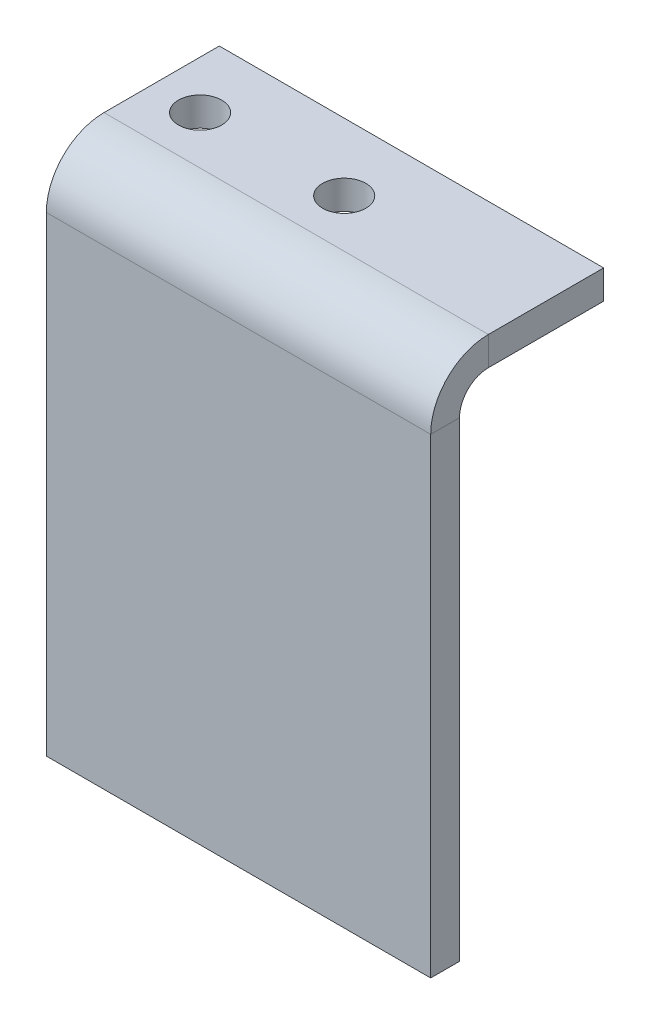
ISO-10303-21;
HEADER;
FILE_DESCRIPTION(('STEP AP214'),'2;1');
FILE_NAME('part.step','',(''),(''),'','','');
FILE_SCHEMA(('AUTOMOTIVE_DESIGN { 1 0 10303 214 1 1 1 1 }'));
ENDSEC;
DATA;
#1=APPLICATION_CONTEXT('core data for automotive mechanical design processes');
#2=APPLICATION_PROTOCOL_DEFINITION('international standard','automotive_design',2000,#1);
#3=PRODUCT_CONTEXT('',#1,'mechanical');
#4=PRODUCT('Part','Part','',(#3));
#5=PRODUCT_RELATED_PRODUCT_CATEGORY('part','',(#4));
#6=PRODUCT_DEFINITION_FORMATION('','',#4);
#7=PRODUCT_DEFINITION_CONTEXT('part definition',#1,'design');
#8=PRODUCT_DEFINITION('design','',#6,#7);
#9=PRODUCT_DEFINITION_SHAPE('','',#8);
#10=(LENGTH_UNIT() NAMED_UNIT(*) SI_UNIT(.MILLI.,.METRE.));
#11=(NAMED_UNIT(*) PLANE_ANGLE_UNIT() SI_UNIT($,.RADIAN.));
#12=(NAMED_UNIT(*) SI_UNIT($,.STERADIAN.) SOLID_ANGLE_UNIT());
#13=UNCERTAINTY_MEASURE_WITH_UNIT(LENGTH_MEASURE(1.E-05),#10,'distance_accuracy_value','');
#14=(GEOMETRIC_REPRESENTATION_CONTEXT(3) GLOBAL_UNCERTAINTY_ASSIGNED_CONTEXT((#13)) GLOBAL_UNIT_ASSIGNED_CONTEXT((#10,
#11,#12)) REPRESENTATION_CONTEXT('',''));
#15=CARTESIAN_POINT('',(0.,0.,0.));
#16=DIRECTION('',(0.,0.,1.));
#17=DIRECTION('',(1.,0.,0.));
#18=AXIS2_PLACEMENT_3D('',#15,#16,#17);
#19=CARTESIAN_POINT('',(20.,-27.5,2.));
#20=DIRECTION('',(-1.,0.,0.));
#21=DIRECTION('',(0.,1.,0.));
#22=AXIS2_PLACEMENT_3D('',#19,#20,#21);
#23=PLANE('',#22);
#24=DIRECTION('',(0.,1.,0.));
#25=VECTOR('',#24,1.);
#26=CARTESIAN_POINT('',(20.,0.,-1.));
#27=LINE('',#26,#25);
#28=CARTESIAN_POINT('',(20.,-27.5,-1.));
#29=VERTEX_POINT('',#28);
#30=CARTESIAN_POINT('',(20.,21.5,-1.));
#31=VERTEX_POINT('',#30);
#32=EDGE_CURVE('E194',#29,#31,#27,.T.);
#33=ORIENTED_EDGE('',*,*,#32,.T.);
#34=DIRECTION('',(0.,0.,1.));
#35=VECTOR('',#34,1.);
#36=CARTESIAN_POINT('',(20.,21.5,-1.));
#37=LINE('',#36,#35);
#38=CARTESIAN_POINT('',(20.,21.5,2.));
#39=VERTEX_POINT('',#38);
#40=EDGE_CURVE('E181',#31,#39,#37,.T.);
#41=ORIENTED_EDGE('',*,*,#40,.T.);
#42=DIRECTION('',(0.,1.,0.));
#43=VECTOR('',#42,1.);
#44=CARTESIAN_POINT('',(20.,-27.5,2.));
#45=LINE('',#44,#43);
#46=CARTESIAN_POINT('',(20.,-27.5,2.));
#47=VERTEX_POINT('',#46);
#48=EDGE_CURVE('E197',#47,#39,#45,.T.);
#49=ORIENTED_EDGE('',*,*,#48,.F.);
#50=DIRECTION('',(0.,0.,1.));
#51=VECTOR('',#50,1.);
#52=CARTESIAN_POINT('',(20.,-27.5,2.));
#53=LINE('',#52,#51);
#54=EDGE_CURVE('E67',#29,#47,#53,.T.);
#55=ORIENTED_EDGE('',*,*,#54,.F.);
#56=EDGE_LOOP('',(#33,#41,#49,#55));
#57=FACE_BOUND('',#56,.T.);
#58=ADVANCED_FACE('F59',(#57),#23,.F.);
#59=CARTESIAN_POINT('',(0.,0.,2.));
#60=DIRECTION('',(0.,0.,-1.));
#61=DIRECTION('',(-1.,0.,0.));
#62=AXIS2_PLACEMENT_3D('',#59,#60,#61);
#63=PLANE('',#62);
#64=DIRECTION('',(1.,0.,0.));
#65=VECTOR('',#64,1.);
#66=CARTESIAN_POINT('',(20.,21.5,2.));
#67=LINE('',#66,#65);
#68=CARTESIAN_POINT('',(-20.,21.5,2.));
#69=VERTEX_POINT('',#68);
#70=EDGE_CURVE('E101',#39,#69,#67,.F.);
#71=ORIENTED_EDGE('',*,*,#70,.T.);
#72=DIRECTION('',(0.,-1.,0.));
#73=VECTOR('',#72,1.);
#74=CARTESIAN_POINT('',(-20.,-27.5,2.));
#75=LINE('',#74,#73);
#76=CARTESIAN_POINT('',(-20.,-27.5,2.));
#77=VERTEX_POINT('',#76);
#78=EDGE_CURVE('E199',#69,#77,#75,.T.);
#79=ORIENTED_EDGE('',*,*,#78,.T.);
#80=DIRECTION('',(1.,0.,0.));
#81=VECTOR('',#80,1.);
#82=CARTESIAN_POINT('',(-20.,-27.5,2.));
#83=LINE('',#82,#81);
#84=EDGE_CURVE('E202',#77,#47,#83,.T.);
#85=ORIENTED_EDGE('',*,*,#84,.T.);
#86=ORIENTED_EDGE('',*,*,#48,.T.);
#87=EDGE_LOOP('',(#71,#79,#85,#86));
#88=FACE_BOUND('',#87,.T.);
#89=ADVANCED_FACE('F262',(#88),#63,.F.);
#90=CARTESIAN_POINT('',(0.,0.,-1.));
#91=DIRECTION('',(0.,0.,-1.));
#92=DIRECTION('',(-1.,0.,0.));
#93=AXIS2_PLACEMENT_3D('',#90,#91,#92);
#94=PLANE('',#93);
#95=DIRECTION('',(0.,1.,0.));
#96=VECTOR('',#95,1.);
#97=CARTESIAN_POINT('',(-20.,0.,-1.));
#98=LINE('',#97,#96);
#99=CARTESIAN_POINT('',(-20.,21.5,-1.));
#100=VERTEX_POINT('',#99);
#101=CARTESIAN_POINT('',(-20.,-27.5,-1.));
#102=VERTEX_POINT('',#101);
#103=EDGE_CURVE('E94',#100,#102,#98,.F.);
#104=ORIENTED_EDGE('',*,*,#103,.F.);
#105=DIRECTION('',(1.,0.,0.));
#106=VECTOR('',#105,1.);
#107=CARTESIAN_POINT('',(20.,21.5,-1.));
#108=LINE('',#107,#106);
#109=EDGE_CURVE('E74',#31,#100,#108,.F.);
#110=ORIENTED_EDGE('',*,*,#109,.F.);
#111=ORIENTED_EDGE('',*,*,#32,.F.);
#112=DIRECTION('',(-1.,0.,0.));
#113=VECTOR('',#112,1.);
#114=CARTESIAN_POINT('',(0.,-27.5,-1.));
#115=LINE('',#114,#113);
#116=EDGE_CURVE('E200',#102,#29,#115,.F.);
#117=ORIENTED_EDGE('',*,*,#116,.F.);
#118=EDGE_LOOP('',(#104,#110,#111,#117));
#119=FACE_BOUND('',#118,.T.);
#120=ADVANCED_FACE('F209',(#119),#94,.T.);
#121=CARTESIAN_POINT('',(-20.,-27.5,2.));
#122=DIRECTION('',(1.,0.,0.));
#123=DIRECTION('',(0.,-1.,0.));
#124=AXIS2_PLACEMENT_3D('',#121,#122,#123);
#125=PLANE('',#124);
#126=DIRECTION('',(0.,0.,1.));
#127=VECTOR('',#126,1.);
#128=CARTESIAN_POINT('',(-20.,21.5,-1.));
#129=LINE('',#128,#127);
#130=EDGE_CURVE('E191',#100,#69,#129,.T.);
#131=ORIENTED_EDGE('',*,*,#130,.F.);
#132=ORIENTED_EDGE('',*,*,#103,.T.);
#133=DIRECTION('',(0.,0.,1.));
#134=VECTOR('',#133,1.);
#135=CARTESIAN_POINT('',(-20.,-27.5,2.));
#136=LINE('',#135,#134);
#137=EDGE_CURVE('E13',#102,#77,#136,.T.);
#138=ORIENTED_EDGE('',*,*,#137,.T.);
#139=ORIENTED_EDGE('',*,*,#78,.F.);
#140=EDGE_LOOP('',(#131,#132,#138,#139));
#141=FACE_BOUND('',#140,.T.);
#142=ADVANCED_FACE('F61',(#141),#125,.F.);
#143=CARTESIAN_POINT('',(-20.,-27.5,2.));
#144=DIRECTION('',(0.,1.,0.));
#145=DIRECTION('',(1.,0.,0.));
#146=AXIS2_PLACEMENT_3D('',#143,#144,#145);
#147=PLANE('',#146);
#148=ORIENTED_EDGE('',*,*,#137,.F.);
#149=ORIENTED_EDGE('',*,*,#116,.T.);
#150=ORIENTED_EDGE('',*,*,#54,.T.);
#151=ORIENTED_EDGE('',*,*,#84,.F.);
#152=EDGE_LOOP('',(#148,#149,#150,#151));
#153=FACE_BOUND('',#152,.T.);
#154=ADVANCED_FACE('F208',(#153),#147,.F.);
#155=CARTESIAN_POINT('',(-20.,21.5,-4.));
#156=DIRECTION('',(-1.,0.,0.));
#157=DIRECTION('',(0.,0.,1.));
#158=AXIS2_PLACEMENT_3D('',#155,#156,#157);
#159=PLANE('',#158);
#160=DIRECTION('',(0.,-1.,0.));
#161=VECTOR('',#160,1.);
#162=CARTESIAN_POINT('',(-20.,27.5,-3.99999999999998));
#163=LINE('',#162,#161);
#164=CARTESIAN_POINT('',(-20.,24.5,-3.99999999999999));
#165=VERTEX_POINT('',#164);
#166=CARTESIAN_POINT('',(-20.,27.5,-3.99999999999998));
#167=VERTEX_POINT('',#166);
#168=EDGE_CURVE('E157',#165,#167,#163,.F.);
#169=ORIENTED_EDGE('',*,*,#168,.F.);
#170=CARTESIAN_POINT('',(-20.,21.5,-4.));
#171=DIRECTION('',(1.,0.,0.));
#172=DIRECTION('',(0.,0.,-1.));
#173=AXIS2_PLACEMENT_3D('',#170,#171,#172);
#174=CIRCLE('',#173,3.);
#175=EDGE_CURVE('E184',#100,#165,#174,.F.);
#176=ORIENTED_EDGE('',*,*,#175,.F.);
#177=ORIENTED_EDGE('',*,*,#130,.T.);
#178=CARTESIAN_POINT('',(-20.,21.5,-4.));
#179=DIRECTION('',(1.,0.,0.));
#180=DIRECTION('',(0.,0.,-1.));
#181=AXIS2_PLACEMENT_3D('',#178,#179,#180);
#182=CIRCLE('',#181,6.);
#183=EDGE_CURVE('E177',#69,#167,#182,.F.);
#184=ORIENTED_EDGE('',*,*,#183,.T.);
#185=EDGE_LOOP('',(#169,#176,#177,#184));
#186=FACE_BOUND('',#185,.T.);
#187=ADVANCED_FACE('F270',(#186),#159,.T.);
#188=CARTESIAN_POINT('',(20.,21.5,-4.));
#189=DIRECTION('',(-1.,0.,0.));
#190=DIRECTION('',(0.,0.,1.));
#191=AXIS2_PLACEMENT_3D('',#188,#189,#190);
#192=PLANE('',#191);
#193=CARTESIAN_POINT('',(20.,21.5,-4.));
#194=DIRECTION('',(1.,0.,0.));
#195=DIRECTION('',(0.,0.,-1.));
#196=AXIS2_PLACEMENT_3D('',#193,#194,#195);
#197=CIRCLE('',#196,3.);
#198=CARTESIAN_POINT('',(20.,24.5,-3.99999999999999));
#199=VERTEX_POINT('',#198);
#200=EDGE_CURVE('E188',#199,#31,#197,.T.);
#201=ORIENTED_EDGE('',*,*,#200,.F.);
#202=DIRECTION('',(0.,-1.,0.));
#203=VECTOR('',#202,1.);
#204=CARTESIAN_POINT('',(20.,24.5,-3.99999999999999));
#205=LINE('',#204,#203);
#206=CARTESIAN_POINT('',(20.,27.5,-3.99999999999998));
#207=VERTEX_POINT('',#206);
#208=EDGE_CURVE('E169',#199,#207,#205,.F.);
#209=ORIENTED_EDGE('',*,*,#208,.T.);
#210=CARTESIAN_POINT('',(20.,21.5,-4.));
#211=DIRECTION('',(1.,0.,0.));
#212=DIRECTION('',(0.,0.,-1.));
#213=AXIS2_PLACEMENT_3D('',#210,#211,#212);
#214=CIRCLE('',#213,6.);
#215=EDGE_CURVE('E178',#207,#39,#214,.T.);
#216=ORIENTED_EDGE('',*,*,#215,.T.);
#217=ORIENTED_EDGE('',*,*,#40,.F.);
#218=EDGE_LOOP('',(#201,#209,#216,#217));
#219=FACE_BOUND('',#218,.T.);
#220=ADVANCED_FACE('F214',(#219),#192,.F.);
#221=CARTESIAN_POINT('',(20.,21.5,-4.));
#222=DIRECTION('',(1.,0.,0.));
#223=DIRECTION('',(0.,1.,0.));
#224=AXIS2_PLACEMENT_3D('',#221,#222,#223);
#225=CYLINDRICAL_SURFACE('',#224,6.);
#226=ORIENTED_EDGE('',*,*,#70,.F.);
#227=ORIENTED_EDGE('',*,*,#215,.F.);
#228=DIRECTION('',(1.,0.,0.));
#229=VECTOR('',#228,1.);
#230=CARTESIAN_POINT('',(-20.,27.5,-3.99999999999998));
#231=LINE('',#230,#229);
#232=EDGE_CURVE('E167',#207,#167,#231,.F.);
#233=ORIENTED_EDGE('',*,*,#232,.T.);
#234=ORIENTED_EDGE('',*,*,#183,.F.);
#235=EDGE_LOOP('',(#226,#227,#233,#234));
#236=FACE_BOUND('',#235,.T.);
#237=ADVANCED_FACE('F282',(#236),#225,.T.);
#238=CARTESIAN_POINT('',(20.,21.5,-4.));
#239=DIRECTION('',(1.,0.,0.));
#240=DIRECTION('',(0.,1.,0.));
#241=AXIS2_PLACEMENT_3D('',#238,#239,#240);
#242=CYLINDRICAL_SURFACE('',#241,3.);
#243=ORIENTED_EDGE('',*,*,#109,.T.);
#244=ORIENTED_EDGE('',*,*,#175,.T.);
#245=DIRECTION('',(1.,0.,0.));
#246=VECTOR('',#245,1.);
#247=CARTESIAN_POINT('',(-20.,24.5,-3.99999999999999));
#248=LINE('',#247,#246);
#249=EDGE_CURVE('E172',#165,#199,#248,.T.);
#250=ORIENTED_EDGE('',*,*,#249,.T.);
#251=ORIENTED_EDGE('',*,*,#200,.T.);
#252=EDGE_LOOP('',(#243,#244,#250,#251));
#253=FACE_BOUND('',#252,.T.);
#254=ADVANCED_FACE('F217',(#253),#242,.F.);
#255=CARTESIAN_POINT('',(20.,27.5000000000001,-16.));
#256=DIRECTION('',(-1.,0.,0.));
#257=DIRECTION('',(0.,0.,1.));
#258=AXIS2_PLACEMENT_3D('',#255,#256,#257);
#259=PLANE('',#258);
#260=ORIENTED_EDGE('',*,*,#208,.F.);
#261=DIRECTION('',(0.,0.,1.));
#262=VECTOR('',#261,1.);
#263=CARTESIAN_POINT('',(20.,24.5000000000001,-16.));
#264=LINE('',#263,#262);
#265=CARTESIAN_POINT('',(20.,24.5000000000001,-16.));
#266=VERTEX_POINT('',#265);
#267=EDGE_CURVE('E165',#199,#266,#264,.F.);
#268=ORIENTED_EDGE('',*,*,#267,.T.);
#269=DIRECTION('',(0.,-1.,0.));
#270=VECTOR('',#269,1.);
#271=CARTESIAN_POINT('',(20.,27.5000000000001,-16.));
#272=LINE('',#271,#270);
#273=CARTESIAN_POINT('',(20.,27.5000000000001,-16.));
#274=VERTEX_POINT('',#273);
#275=EDGE_CURVE('E153',#274,#266,#272,.T.);
#276=ORIENTED_EDGE('',*,*,#275,.F.);
#277=DIRECTION('',(0.,0.,-1.));
#278=VECTOR('',#277,1.);
#279=CARTESIAN_POINT('',(20.,27.5,1.05884235195254E-13));
#280=LINE('',#279,#278);
#281=EDGE_CURVE('E140',#207,#274,#280,.T.);
#282=ORIENTED_EDGE('',*,*,#281,.F.);
#283=EDGE_LOOP('',(#260,#268,#276,#282));
#284=FACE_BOUND('',#283,.T.);
#285=ADVANCED_FACE('F224',(#284),#259,.F.);
#286=CARTESIAN_POINT('',(-20.,27.5,-0.99999999999999));
#287=DIRECTION('',(1.,0.,0.));
#288=DIRECTION('',(0.,0.,-1.));
#289=AXIS2_PLACEMENT_3D('',#286,#287,#288);
#290=PLANE('',#289);
#291=ORIENTED_EDGE('',*,*,#168,.T.);
#292=DIRECTION('',(0.,0.,1.));
#293=VECTOR('',#292,1.);
#294=CARTESIAN_POINT('',(-20.,27.5,1.05884235195254E-13));
#295=LINE('',#294,#293);
#296=CARTESIAN_POINT('',(-20.,27.5000000000001,-16.));
#297=VERTEX_POINT('',#296);
#298=EDGE_CURVE('E138',#297,#167,#295,.T.);
#299=ORIENTED_EDGE('',*,*,#298,.F.);
#300=DIRECTION('',(0.,-1.,0.));
#301=VECTOR('',#300,1.);
#302=CARTESIAN_POINT('',(-20.,27.5000000000001,-16.));
#303=LINE('',#302,#301);
#304=CARTESIAN_POINT('',(-20.,24.5000000000001,-16.));
#305=VERTEX_POINT('',#304);
#306=EDGE_CURVE('E146',#297,#305,#303,.T.);
#307=ORIENTED_EDGE('',*,*,#306,.T.);
#308=DIRECTION('',(0.,0.,-1.));
#309=VECTOR('',#308,1.);
#310=CARTESIAN_POINT('',(-20.,24.5,-1.));
#311=LINE('',#310,#309);
#312=EDGE_CURVE('E162',#305,#165,#311,.F.);
#313=ORIENTED_EDGE('',*,*,#312,.T.);
#314=EDGE_LOOP('',(#291,#299,#307,#313));
#315=FACE_BOUND('',#314,.T.);
#316=ADVANCED_FACE('F156',(#315),#290,.F.);
#317=CARTESIAN_POINT('',(0.,27.5,1.05884235195254E-13));
#318=DIRECTION('',(0.,-1.,0.));
#319=DIRECTION('',(0.,0.,-1.));
#320=AXIS2_PLACEMENT_3D('',#317,#318,#319);
#321=PLANE('',#320);
#322=CARTESIAN_POINT('',(-15.,27.5000000000001,-8.99999999999998));
#323=DIRECTION('',(0.,-1.,0.));
#324=DIRECTION('',(0.,0.,-1.));
#325=AXIS2_PLACEMENT_3D('',#322,#323,#324);
#326=CIRCLE('',#325,2.25);
#327=CARTESIAN_POINT('',(-15.,27.5000000000001,-11.25));
#328=VERTEX_POINT('',#327);
#329=EDGE_CURVE('E175',#328,#328,#326,.T.);
#330=ORIENTED_EDGE('',*,*,#329,.T.);
#331=EDGE_LOOP('',(#330));
#332=FACE_BOUND('',#331,.T.);
#333=CARTESIAN_POINT('',(0.,27.5000000000001,-8.99999999999998));
#334=DIRECTION('',(0.,-1.,0.));
#335=DIRECTION('',(0.,0.,-1.));
#336=AXIS2_PLACEMENT_3D('',#333,#334,#335);
#337=CIRCLE('',#336,2.25);
#338=CARTESIAN_POINT('',(0.,27.5000000000001,-11.25));
#339=VERTEX_POINT('',#338);
#340=EDGE_CURVE('E229',#339,#339,#337,.T.);
#341=ORIENTED_EDGE('',*,*,#340,.T.);
#342=EDGE_LOOP('',(#341));
#343=FACE_BOUND('',#342,.T.);
#344=ORIENTED_EDGE('',*,*,#232,.F.);
#345=ORIENTED_EDGE('',*,*,#281,.T.);
#346=DIRECTION('',(-1.,0.,0.));
#347=VECTOR('',#346,1.);
#348=CARTESIAN_POINT('',(0.,27.5000000000001,-16.));
#349=LINE('',#348,#347);
#350=EDGE_CURVE('E133',#274,#297,#349,.T.);
#351=ORIENTED_EDGE('',*,*,#350,.T.);
#352=ORIENTED_EDGE('',*,*,#298,.T.);
#353=EDGE_LOOP('',(#344,#345,#351,#352));
#354=FACE_BOUND('',#353,.T.);
#355=ADVANCED_FACE('F136',(#332,#343,#354),#321,.F.);
#356=CARTESIAN_POINT('',(0.,24.5,0.));
#357=DIRECTION('',(0.,-1.,0.));
#358=DIRECTION('',(0.,0.,-1.));
#359=AXIS2_PLACEMENT_3D('',#356,#357,#358);
#360=PLANE('',#359);
#361=CARTESIAN_POINT('',(-15.,24.5,-8.99999999999999));
#362=DIRECTION('',(0.,-1.,0.));
#363=DIRECTION('',(0.,0.,-1.));
#364=AXIS2_PLACEMENT_3D('',#361,#362,#363);
#365=CIRCLE('',#364,2.25);
#366=CARTESIAN_POINT('',(-15.,24.5,-11.25));
#367=VERTEX_POINT('',#366);
#368=EDGE_CURVE('E232',#367,#367,#365,.T.);
#369=ORIENTED_EDGE('',*,*,#368,.F.);
#370=EDGE_LOOP('',(#369));
#371=FACE_BOUND('',#370,.T.);
#372=CARTESIAN_POINT('',(0.,24.5,-8.99999999999999));
#373=DIRECTION('',(0.,-1.,0.));
#374=DIRECTION('',(0.,0.,-1.));
#375=AXIS2_PLACEMENT_3D('',#372,#373,#374);
#376=CIRCLE('',#375,2.25);
#377=CARTESIAN_POINT('',(0.,24.5,-11.25));
#378=VERTEX_POINT('',#377);
#379=EDGE_CURVE('E226',#378,#378,#376,.T.);
#380=ORIENTED_EDGE('',*,*,#379,.F.);
#381=EDGE_LOOP('',(#380));
#382=FACE_BOUND('',#381,.T.);
#383=ORIENTED_EDGE('',*,*,#267,.F.);
#384=ORIENTED_EDGE('',*,*,#249,.F.);
#385=ORIENTED_EDGE('',*,*,#312,.F.);
#386=DIRECTION('',(1.,0.,0.));
#387=VECTOR('',#386,1.);
#388=CARTESIAN_POINT('',(-20.,24.5000000000001,-16.));
#389=LINE('',#388,#387);
#390=EDGE_CURVE('E149',#266,#305,#389,.F.);
#391=ORIENTED_EDGE('',*,*,#390,.F.);
#392=EDGE_LOOP('',(#383,#384,#385,#391));
#393=FACE_BOUND('',#392,.T.);
#394=ADVANCED_FACE('F222',(#371,#382,#393),#360,.T.);
#395=CARTESIAN_POINT('',(-20.,27.5000000000001,-16.));
#396=DIRECTION('',(0.,0.,1.));
#397=DIRECTION('',(0.,-1.,0.));
#398=AXIS2_PLACEMENT_3D('',#395,#396,#397);
#399=PLANE('',#398);
#400=ORIENTED_EDGE('',*,*,#390,.T.);
#401=ORIENTED_EDGE('',*,*,#306,.F.);
#402=ORIENTED_EDGE('',*,*,#350,.F.);
#403=ORIENTED_EDGE('',*,*,#275,.T.);
#404=EDGE_LOOP('',(#400,#401,#402,#403));
#405=FACE_BOUND('',#404,.T.);
#406=ADVANCED_FACE('F147',(#405),#399,.F.);
#407=CARTESIAN_POINT('',(0.,27.5000000000001,-8.99999999999998));
#408=DIRECTION('',(0.,-1.,0.));
#409=DIRECTION('',(0.,0.,-1.));
#410=AXIS2_PLACEMENT_3D('',#407,#408,#409);
#411=CYLINDRICAL_SURFACE('',#410,2.25);
#412=ORIENTED_EDGE('',*,*,#340,.F.);
#413=EDGE_LOOP('',(#412));
#414=FACE_BOUND('',#413,.T.);
#415=ORIENTED_EDGE('',*,*,#379,.T.);
#416=EDGE_LOOP('',(#415));
#417=FACE_BOUND('',#416,.T.);
#418=ADVANCED_FACE('F243',(#414,#417),#411,.F.);
#419=CARTESIAN_POINT('',(-15.,27.5000000000001,-8.99999999999998));
#420=DIRECTION('',(0.,-1.,0.));
#421=DIRECTION('',(0.,0.,-1.));
#422=AXIS2_PLACEMENT_3D('',#419,#420,#421);
#423=CYLINDRICAL_SURFACE('',#422,2.25);
#424=ORIENTED_EDGE('',*,*,#329,.F.);
#425=EDGE_LOOP('',(#424));
#426=FACE_BOUND('',#425,.T.);
#427=ORIENTED_EDGE('',*,*,#368,.T.);
#428=EDGE_LOOP('',(#427));
#429=FACE_BOUND('',#428,.T.);
#430=ADVANCED_FACE('F240',(#426,#429),#423,.F.);
#431=CLOSED_SHELL('',(#58,#89,#120,#142,#154,#187,#220,#237,#254,#285,#316,#355,#394,#406,#418,#430));
#432=MANIFOLD_SOLID_BREP('B2',#431);
#433=ADVANCED_BREP_SHAPE_REPRESENTATION('',(#18,#432),#14);
#434=SHAPE_DEFINITION_REPRESENTATION(#9,#433);
ENDSEC;
END-ISO-10303-21;
